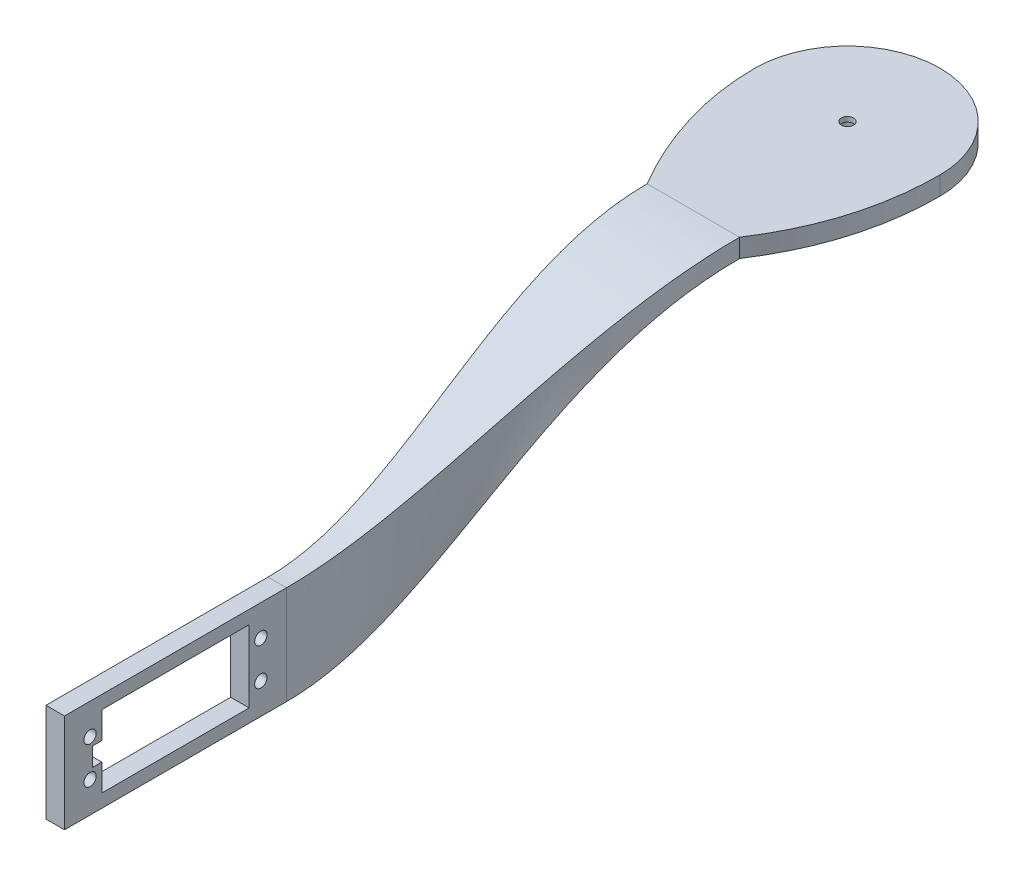
ISO-10303-21;
HEADER;
FILE_DESCRIPTION(('STEP AP214'),'2;1');
FILE_NAME('part.step','',(''),(''),'','','');
FILE_SCHEMA(('AUTOMOTIVE_DESIGN { 1 0 10303 214 1 1 1 1 }'));
ENDSEC;
DATA;
#1=APPLICATION_CONTEXT('core data for automotive mechanical design processes');
#2=APPLICATION_PROTOCOL_DEFINITION('international standard','automotive_design',2000,#1);
#3=PRODUCT_CONTEXT('',#1,'mechanical');
#4=PRODUCT('Part','Part','',(#3));
#5=PRODUCT_RELATED_PRODUCT_CATEGORY('part','',(#4));
#6=PRODUCT_DEFINITION_FORMATION('','',#4);
#7=PRODUCT_DEFINITION_CONTEXT('part definition',#1,'design');
#8=PRODUCT_DEFINITION('design','',#6,#7);
#9=PRODUCT_DEFINITION_SHAPE('','',#8);
#10=(LENGTH_UNIT() NAMED_UNIT(*) SI_UNIT(.MILLI.,.METRE.));
#11=(NAMED_UNIT(*) PLANE_ANGLE_UNIT() SI_UNIT($,.RADIAN.));
#12=(NAMED_UNIT(*) SI_UNIT($,.STERADIAN.) SOLID_ANGLE_UNIT());
#13=UNCERTAINTY_MEASURE_WITH_UNIT(LENGTH_MEASURE(1.E-05),#10,'distance_accuracy_value','');
#14=(GEOMETRIC_REPRESENTATION_CONTEXT(3) GLOBAL_UNCERTAINTY_ASSIGNED_CONTEXT((#13)) GLOBAL_UNIT_ASSIGNED_CONTEXT((#10,
#11,#12)) REPRESENTATION_CONTEXT('',''));
#15=CARTESIAN_POINT('',(0.,0.,0.));
#16=DIRECTION('',(0.,0.,1.));
#17=DIRECTION('',(1.,0.,0.));
#18=AXIS2_PLACEMENT_3D('',#15,#16,#17);
#19=CARTESIAN_POINT('',(-13.125,0.,12.3525004022516));
#20=DIRECTION('',(0.,-1.,0.));
#21=DIRECTION('',(0.,0.,-1.));
#22=AXIS2_PLACEMENT_3D('',#19,#20,#21);
#23=PLANE('',#22);
#24=CARTESIAN_POINT('',(-15.,0.,0.));
#25=CARTESIAN_POINT('',(-15.,0.,12.2050008045032));
#26=CARTESIAN_POINT('',(-7.49999999999999,0.,25.));
#27=B_SPLINE_CURVE_WITH_KNOTS('',2,(#24,#25,#26),.UNSPECIFIED.,.F.,.F.,(3,3),(0.,1.),.UNSPECIFIED.);
#28=CARTESIAN_POINT('',(-15.,0.,0.));
#29=VERTEX_POINT('',#28);
#30=CARTESIAN_POINT('',(-7.49999999999999,0.,25.));
#31=VERTEX_POINT('',#30);
#32=EDGE_CURVE('E303',#29,#31,#27,.T.);
#33=ORIENTED_EDGE('',*,*,#32,.F.);
#34=CARTESIAN_POINT('',(0.,0.,0.));
#35=DIRECTION('',(0.,1.,0.));
#36=DIRECTION('',(0.,0.,1.));
#37=AXIS2_PLACEMENT_3D('',#34,#35,#36);
#38=CIRCLE('',#37,15.);
#39=CARTESIAN_POINT('',(15.,0.,0.));
#40=VERTEX_POINT('',#39);
#41=EDGE_CURVE('E307',#40,#29,#38,.T.);
#42=ORIENTED_EDGE('',*,*,#41,.F.);
#43=CARTESIAN_POINT('',(7.5,0.,25.));
#44=CARTESIAN_POINT('',(15.,0.,13.5680719507911));
#45=CARTESIAN_POINT('',(15.,0.,0.));
#46=B_SPLINE_CURVE_WITH_KNOTS('',2,(#43,#44,#45),.UNSPECIFIED.,.F.,.F.,(3,3),(0.,1.),.UNSPECIFIED.);
#47=CARTESIAN_POINT('',(7.5,0.,25.));
#48=VERTEX_POINT('',#47);
#49=EDGE_CURVE('E380',#48,#40,#46,.T.);
#50=ORIENTED_EDGE('',*,*,#49,.F.);
#51=DIRECTION('',(1.,0.,0.));
#52=VECTOR('',#51,1.);
#53=CARTESIAN_POINT('',(-13.125,0.,25.));
#54=LINE('',#53,#52);
#55=EDGE_CURVE('E379',#31,#48,#54,.T.);
#56=ORIENTED_EDGE('',*,*,#55,.F.);
#57=EDGE_LOOP('',(#33,#42,#50,#56));
#58=FACE_BOUND('',#57,.T.);
#59=CARTESIAN_POINT('',(0.,0.,0.));
#60=DIRECTION('',(0.,-1.,0.));
#61=DIRECTION('',(0.,0.,-1.));
#62=AXIS2_PLACEMENT_3D('',#59,#60,#61);
#63=CIRCLE('',#62,4.);
#64=CARTESIAN_POINT('',(0.,0.,-4.));
#65=VERTEX_POINT('',#64);
#66=EDGE_CURVE('E298',#65,#65,#63,.T.);
#67=ORIENTED_EDGE('',*,*,#66,.F.);
#68=EDGE_LOOP('',(#67));
#69=FACE_BOUND('',#68,.T.);
#70=ADVANCED_FACE('F79',(#58,#69),#23,.T.);
#71=CARTESIAN_POINT('',(-15.,3.,0.));
#72=CARTESIAN_POINT('',(-15.,3.,12.2050008045032));
#73=CARTESIAN_POINT('',(-7.49999999999999,3.,25.));
#74=B_SPLINE_CURVE_WITH_KNOTS('',2,(#71,#72,#73),.UNSPECIFIED.,.F.,.F.,(3,3),(0.,1.),.UNSPECIFIED.);
#75=DIRECTION('',(0.,-1.,0.));
#76=VECTOR('',#75,1.);
#77=SURFACE_OF_LINEAR_EXTRUSION('',#74,#76);
#78=ORIENTED_EDGE('',*,*,#32,.T.);
#79=DIRECTION('',(0.,-1.,0.));
#80=VECTOR('',#79,1.);
#81=CARTESIAN_POINT('',(-7.49999999999999,3.,25.));
#82=LINE('',#81,#80);
#83=CARTESIAN_POINT('',(-7.49999999999999,3.00000000000001,25.));
#84=VERTEX_POINT('',#83);
#85=EDGE_CURVE('E149',#84,#31,#82,.T.);
#86=ORIENTED_EDGE('',*,*,#85,.F.);
#87=CARTESIAN_POINT('',(-15.,3.,0.));
#88=VERTEX_POINT('',#87);
#89=EDGE_CURVE('E124',#88,#84,#74,.T.);
#90=ORIENTED_EDGE('',*,*,#89,.F.);
#91=DIRECTION('',(0.,-1.,0.));
#92=VECTOR('',#91,1.);
#93=CARTESIAN_POINT('',(-15.,3.,0.));
#94=LINE('',#93,#92);
#95=EDGE_CURVE('E457',#88,#29,#94,.T.);
#96=ORIENTED_EDGE('',*,*,#95,.T.);
#97=EDGE_LOOP('',(#78,#86,#90,#96));
#98=FACE_BOUND('',#97,.T.);
#99=ADVANCED_FACE('F315',(#98),#77,.F.);
#100=CARTESIAN_POINT('',(7.5,3.,25.));
#101=CARTESIAN_POINT('',(15.,3.,13.5680719507911));
#102=CARTESIAN_POINT('',(15.,3.,0.));
#103=B_SPLINE_CURVE_WITH_KNOTS('',2,(#100,#101,#102),.UNSPECIFIED.,.F.,.F.,(3,3),(0.,1.),.UNSPECIFIED.);
#104=DIRECTION('',(0.,-1.,0.));
#105=VECTOR('',#104,1.);
#106=SURFACE_OF_LINEAR_EXTRUSION('',#103,#105);
#107=ORIENTED_EDGE('',*,*,#49,.T.);
#108=DIRECTION('',(0.,-1.,0.));
#109=VECTOR('',#108,1.);
#110=CARTESIAN_POINT('',(15.,3.,0.));
#111=LINE('',#110,#109);
#112=CARTESIAN_POINT('',(15.,3.,0.));
#113=VERTEX_POINT('',#112);
#114=EDGE_CURVE('E138',#113,#40,#111,.T.);
#115=ORIENTED_EDGE('',*,*,#114,.F.);
#116=CARTESIAN_POINT('',(7.5,3.,25.));
#117=VERTEX_POINT('',#116);
#118=EDGE_CURVE('E121',#117,#113,#103,.T.);
#119=ORIENTED_EDGE('',*,*,#118,.F.);
#120=DIRECTION('',(0.,-1.,0.));
#121=VECTOR('',#120,1.);
#122=CARTESIAN_POINT('',(7.5,3.,25.));
#123=LINE('',#122,#121);
#124=EDGE_CURVE('E135',#117,#48,#123,.T.);
#125=ORIENTED_EDGE('',*,*,#124,.T.);
#126=EDGE_LOOP('',(#107,#115,#119,#125));
#127=FACE_BOUND('',#126,.T.);
#128=ADVANCED_FACE('F134',(#127),#106,.F.);
#129=CARTESIAN_POINT('',(0.,3.,0.));
#130=DIRECTION('',(0.,-1.,0.));
#131=DIRECTION('',(0.,0.,-1.));
#132=AXIS2_PLACEMENT_3D('',#129,#130,#131);
#133=CYLINDRICAL_SURFACE('',#132,15.);
#134=ORIENTED_EDGE('',*,*,#41,.T.);
#135=ORIENTED_EDGE('',*,*,#95,.F.);
#136=CARTESIAN_POINT('',(0.,3.,0.));
#137=DIRECTION('',(0.,1.,0.));
#138=DIRECTION('',(0.,0.,1.));
#139=AXIS2_PLACEMENT_3D('',#136,#137,#138);
#140=CIRCLE('',#139,15.);
#141=EDGE_CURVE('E99',#113,#88,#140,.T.);
#142=ORIENTED_EDGE('',*,*,#141,.F.);
#143=ORIENTED_EDGE('',*,*,#114,.T.);
#144=EDGE_LOOP('',(#134,#135,#142,#143));
#145=FACE_BOUND('',#144,.T.);
#146=ADVANCED_FACE('F321',(#145),#133,.T.);
#147=CARTESIAN_POINT('',(-13.125,3.,12.3525004022516));
#148=DIRECTION('',(0.,-1.,0.));
#149=DIRECTION('',(0.,0.,-1.));
#150=AXIS2_PLACEMENT_3D('',#147,#148,#149);
#151=PLANE('',#150);
#152=CARTESIAN_POINT('',(0.,3.,0.));
#153=DIRECTION('',(0.,-1.,0.));
#154=DIRECTION('',(0.,0.,-1.));
#155=AXIS2_PLACEMENT_3D('',#152,#153,#154);
#156=CIRCLE('',#155,1.);
#157=CARTESIAN_POINT('',(0.,3.,-1.));
#158=VERTEX_POINT('',#157);
#159=EDGE_CURVE('E287',#158,#158,#156,.T.);
#160=ORIENTED_EDGE('',*,*,#159,.T.);
#161=EDGE_LOOP('',(#160));
#162=FACE_BOUND('',#161,.T.);
#163=ORIENTED_EDGE('',*,*,#89,.T.);
#164=DIRECTION('',(1.,0.,0.));
#165=VECTOR('',#164,1.);
#166=CARTESIAN_POINT('',(-13.125,3.,25.));
#167=LINE('',#166,#165);
#168=EDGE_CURVE('E118',#84,#117,#167,.T.);
#169=ORIENTED_EDGE('',*,*,#168,.T.);
#170=ORIENTED_EDGE('',*,*,#118,.T.);
#171=ORIENTED_EDGE('',*,*,#141,.T.);
#172=EDGE_LOOP('',(#163,#169,#170,#171));
#173=FACE_BOUND('',#172,.T.);
#174=ADVANCED_FACE('F120',(#162,#173),#151,.F.);
#175=CARTESIAN_POINT('',(0.,-1.,0.));
#176=DIRECTION('',(0.,1.,0.));
#177=DIRECTION('',(0.,0.,1.));
#178=AXIS2_PLACEMENT_3D('',#175,#176,#177);
#179=CYLINDRICAL_SURFACE('',#178,4.);
#180=CARTESIAN_POINT('',(0.,-0.300000000000003,0.));
#181=DIRECTION('',(0.,-1.,0.));
#182=DIRECTION('',(0.,0.,-1.));
#183=AXIS2_PLACEMENT_3D('',#180,#181,#182);
#184=CIRCLE('',#183,4.);
#185=CARTESIAN_POINT('',(0.,-0.300000000000003,-4.));
#186=VERTEX_POINT('',#185);
#187=EDGE_CURVE('E13',#186,#186,#184,.F.);
#188=ORIENTED_EDGE('',*,*,#187,.T.);
#189=EDGE_LOOP('',(#188));
#190=FACE_BOUND('',#189,.T.);
#191=ORIENTED_EDGE('',*,*,#66,.T.);
#192=EDGE_LOOP('',(#191));
#193=FACE_BOUND('',#192,.T.);
#194=ADVANCED_FACE('F330',(#190,#193),#179,.T.);
#195=CARTESIAN_POINT('',(0.,-1.,0.));
#196=DIRECTION('',(0.,-1.,0.));
#197=DIRECTION('',(0.,0.,-1.));
#198=AXIS2_PLACEMENT_3D('',#195,#196,#197);
#199=PLANE('',#198);
#200=CARTESIAN_POINT('',(0.,-1.,0.));
#201=DIRECTION('',(0.,-1.,0.));
#202=DIRECTION('',(0.,0.,-1.));
#203=AXIS2_PLACEMENT_3D('',#200,#201,#202);
#204=CIRCLE('',#203,3.3);
#205=CARTESIAN_POINT('',(0.,-1.,-3.3));
#206=VERTEX_POINT('',#205);
#207=EDGE_CURVE('E90',#206,#206,#204,.T.);
#208=ORIENTED_EDGE('',*,*,#207,.T.);
#209=EDGE_LOOP('',(#208));
#210=FACE_BOUND('',#209,.T.);
#211=CARTESIAN_POINT('',(0.,-1.,0.));
#212=DIRECTION('',(0.,-1.,0.));
#213=DIRECTION('',(0.,0.,-1.));
#214=AXIS2_PLACEMENT_3D('',#211,#212,#213);
#215=CIRCLE('',#214,2.45);
#216=CARTESIAN_POINT('',(0.,-1.,-2.45));
#217=VERTEX_POINT('',#216);
#218=EDGE_CURVE('E290',#217,#217,#215,.T.);
#219=ORIENTED_EDGE('',*,*,#218,.F.);
#220=EDGE_LOOP('',(#219));
#221=FACE_BOUND('',#220,.T.);
#222=ADVANCED_FACE('F334',(#210,#221),#199,.T.);
#223=CARTESIAN_POINT('',(0.,2.2,0.));
#224=DIRECTION('',(0.,-1.,0.));
#225=DIRECTION('',(0.,0.,-1.));
#226=AXIS2_PLACEMENT_3D('',#223,#224,#225);
#227=CYLINDRICAL_SURFACE('',#226,2.45);
#228=CARTESIAN_POINT('',(0.,2.2,0.));
#229=DIRECTION('',(0.,-1.,0.));
#230=DIRECTION('',(0.,0.,-1.));
#231=AXIS2_PLACEMENT_3D('',#228,#229,#230);
#232=CIRCLE('',#231,2.45);
#233=CARTESIAN_POINT('',(0.,2.2,-2.45));
#234=VERTEX_POINT('',#233);
#235=EDGE_CURVE('E295',#234,#234,#232,.T.);
#236=ORIENTED_EDGE('',*,*,#235,.F.);
#237=EDGE_LOOP('',(#236));
#238=FACE_BOUND('',#237,.T.);
#239=ORIENTED_EDGE('',*,*,#218,.T.);
#240=EDGE_LOOP('',(#239));
#241=FACE_BOUND('',#240,.T.);
#242=ADVANCED_FACE('F338',(#238,#241),#227,.F.);
#243=CARTESIAN_POINT('',(0.,2.2,0.));
#244=DIRECTION('',(0.,-1.,0.));
#245=DIRECTION('',(0.,0.,-1.));
#246=AXIS2_PLACEMENT_3D('',#243,#244,#245);
#247=PLANE('',#246);
#248=CARTESIAN_POINT('',(0.,2.2,0.));
#249=DIRECTION('',(0.,-1.,0.));
#250=DIRECTION('',(0.,0.,-1.));
#251=AXIS2_PLACEMENT_3D('',#248,#249,#250);
#252=CIRCLE('',#251,1.);
#253=CARTESIAN_POINT('',(0.,2.2,-1.));
#254=VERTEX_POINT('',#253);
#255=EDGE_CURVE('E291',#254,#254,#252,.T.);
#256=ORIENTED_EDGE('',*,*,#255,.F.);
#257=EDGE_LOOP('',(#256));
#258=FACE_BOUND('',#257,.T.);
#259=ORIENTED_EDGE('',*,*,#235,.T.);
#260=EDGE_LOOP('',(#259));
#261=FACE_BOUND('',#260,.T.);
#262=ADVANCED_FACE('F341',(#258,#261),#247,.T.);
#263=CARTESIAN_POINT('',(0.,3.,0.));
#264=DIRECTION('',(0.,-1.,0.));
#265=DIRECTION('',(0.,0.,-1.));
#266=AXIS2_PLACEMENT_3D('',#263,#264,#265);
#267=CYLINDRICAL_SURFACE('',#266,1.);
#268=CARTESIAN_POINT('',(0.,3.,-1.));
#269=CARTESIAN_POINT('',(0.,2.99166666666667,-1.));
#270=CARTESIAN_POINT('',(0.,2.98333333333333,-1.));
#271=CARTESIAN_POINT('',(0.,2.96666666666667,-1.));
#272=CARTESIAN_POINT('',(0.,2.95833333333333,-1.));
#273=CARTESIAN_POINT('',(0.,2.94166666666667,-1.));
#274=CARTESIAN_POINT('',(0.,2.93333333333333,-1.));
#275=CARTESIAN_POINT('',(0.,2.91666666666667,-1.));
#276=CARTESIAN_POINT('',(0.,2.90833333333333,-1.));
#277=CARTESIAN_POINT('',(0.,2.89166666666667,-1.));
#278=CARTESIAN_POINT('',(0.,2.88333333333333,-1.));
#279=CARTESIAN_POINT('',(0.,2.86666666666667,-1.));
#280=CARTESIAN_POINT('',(0.,2.85833333333333,-1.));
#281=CARTESIAN_POINT('',(0.,2.84166666666667,-1.));
#282=CARTESIAN_POINT('',(0.,2.83333333333333,-1.));
#283=CARTESIAN_POINT('',(0.,2.81666666666667,-1.));
#284=CARTESIAN_POINT('',(0.,2.80833333333333,-1.));
#285=CARTESIAN_POINT('',(0.,2.79166666666667,-1.));
#286=CARTESIAN_POINT('',(0.,2.78333333333333,-1.));
#287=CARTESIAN_POINT('',(0.,2.76666666666667,-1.));
#288=CARTESIAN_POINT('',(0.,2.75833333333333,-1.));
#289=CARTESIAN_POINT('',(0.,2.74166666666667,-1.));
#290=CARTESIAN_POINT('',(0.,2.73333333333333,-1.));
#291=CARTESIAN_POINT('',(0.,2.71666666666667,-1.));
#292=CARTESIAN_POINT('',(0.,2.70833333333333,-1.));
#293=CARTESIAN_POINT('',(0.,2.69166666666667,-1.));
#294=CARTESIAN_POINT('',(0.,2.68333333333333,-1.));
#295=CARTESIAN_POINT('',(0.,2.66666666666667,-1.));
#296=CARTESIAN_POINT('',(0.,2.65833333333333,-1.));
#297=CARTESIAN_POINT('',(0.,2.64166666666667,-1.));
#298=CARTESIAN_POINT('',(0.,2.63333333333333,-1.));
#299=CARTESIAN_POINT('',(0.,2.61666666666667,-1.));
#300=CARTESIAN_POINT('',(0.,2.60833333333333,-1.));
#301=CARTESIAN_POINT('',(0.,2.59166666666667,-1.));
#302=CARTESIAN_POINT('',(0.,2.58333333333333,-1.));
#303=CARTESIAN_POINT('',(0.,2.56666666666667,-1.));
#304=CARTESIAN_POINT('',(0.,2.55833333333333,-1.));
#305=CARTESIAN_POINT('',(0.,2.54166666666667,-1.));
#306=CARTESIAN_POINT('',(0.,2.53333333333333,-1.));
#307=CARTESIAN_POINT('',(0.,2.51666666666667,-1.));
#308=CARTESIAN_POINT('',(0.,2.50833333333333,-1.));
#309=CARTESIAN_POINT('',(0.,2.49166666666667,-1.));
#310=CARTESIAN_POINT('',(0.,2.48333333333333,-1.));
#311=CARTESIAN_POINT('',(0.,2.46666666666667,-1.));
#312=CARTESIAN_POINT('',(0.,2.45833333333333,-1.));
#313=CARTESIAN_POINT('',(0.,2.44166666666667,-1.));
#314=CARTESIAN_POINT('',(0.,2.43333333333333,-1.));
#315=CARTESIAN_POINT('',(0.,2.41666666666667,-1.));
#316=CARTESIAN_POINT('',(0.,2.40833333333333,-1.));
#317=CARTESIAN_POINT('',(0.,2.39166666666667,-1.));
#318=CARTESIAN_POINT('',(0.,2.38333333333333,-1.));
#319=CARTESIAN_POINT('',(0.,2.36666666666667,-1.));
#320=CARTESIAN_POINT('',(0.,2.35833333333333,-1.));
#321=CARTESIAN_POINT('',(0.,2.34166666666667,-1.));
#322=CARTESIAN_POINT('',(0.,2.33333333333333,-1.));
#323=CARTESIAN_POINT('',(0.,2.31666666666667,-1.));
#324=CARTESIAN_POINT('',(0.,2.30833333333333,-1.));
#325=CARTESIAN_POINT('',(0.,2.29166666666667,-1.));
#326=CARTESIAN_POINT('',(0.,2.28333333333333,-1.));
#327=CARTESIAN_POINT('',(0.,2.26666666666667,-1.));
#328=CARTESIAN_POINT('',(0.,2.25833333333333,-1.));
#329=CARTESIAN_POINT('',(0.,2.24166666666667,-1.));
#330=CARTESIAN_POINT('',(0.,2.23333333333333,-1.));
#331=CARTESIAN_POINT('',(0.,2.21666666666667,-1.));
#332=CARTESIAN_POINT('',(0.,2.20833333333333,-1.));
#333=CARTESIAN_POINT('',(0.,2.2,-1.));
#334=B_SPLINE_CURVE_WITH_KNOTS('',3,(#268,#269,#270,#271,#272,#273,#274,#275,#276,#277,#278,
#279,#280,#281,#282,#283,#284,#285,#286,#287,#288,#289,#290,#291,#292,#293,#294,#295,#296,#297,
#298,#299,#300,#301,#302,#303,#304,#305,#306,#307,#308,#309,#310,#311,#312,#313,#314,#315,#316,
#317,#318,#319,#320,#321,#322,#323,#324,#325,#326,#327,#328,#329,#330,#331,#332,#333),
.UNSPECIFIED.,.F.,.F.,(4,2,2,2,2,2,2,2,2,2,2,2,2,2,2,2,2,2,2,2,2,2,2,2,2,2,2,2,2,2,2,2,4),(0.,
0.0249999999999998,0.0499999999999997,0.075,0.0999999999999998,0.125,0.15,0.175,0.2,0.225,0.25,
0.275,0.3,0.325,0.35,0.375,0.4,0.425,0.45,0.475,0.5,0.525,0.55,0.575,0.6,0.625,0.65,0.675,0.7,
0.725,0.75,0.775,0.8),.UNSPECIFIED.);
#335=EDGE_CURVE('BSEAM206',#158,#254,#334,.T.);
#336=ORIENTED_EDGE('',*,*,#159,.F.);
#337=ORIENTED_EDGE('',*,*,#255,.T.);
#338=ORIENTED_EDGE('',*,*,#335,.T.);
#339=ORIENTED_EDGE('',*,*,#335,.F.);
#340=EDGE_LOOP('',(#336,#338,#337,#339));
#341=FACE_BOUND('',#340,.T.);
#342=ADVANCED_FACE('F206',(#341),#267,.F.);
#343=CARTESIAN_POINT('',(0.,-1.,0.));
#344=DIRECTION('',(0.,1.,0.));
#345=DIRECTION('',(0.,0.,1.));
#346=AXIS2_PLACEMENT_3D('',#343,#344,#345);
#347=CONICAL_SURFACE('',#346,3.3,0.785398163397447);
#348=ORIENTED_EDGE('',*,*,#187,.F.);
#349=EDGE_LOOP('',(#348));
#350=FACE_BOUND('',#349,.T.);
#351=ORIENTED_EDGE('',*,*,#207,.F.);
#352=EDGE_LOOP('',(#351));
#353=FACE_BOUND('',#352,.T.);
#354=ADVANCED_FACE('F81',(#350,#353),#347,.T.);
#355=CARTESIAN_POINT('',(-7.5,3.,25.));
#356=CARTESIAN_POINT('',(-7.5,3.,50.2919459825624));
#357=CARTESIAN_POINT('',(-10.,-24.,62.3557806717853));
#358=CARTESIAN_POINT('',(-10.,-24.,84.));
#359=CARTESIAN_POINT('',(-7.5,2.,25.));
#360=CARTESIAN_POINT('',(-7.5,2.,52.1674516499134));
#361=CARTESIAN_POINT('',(-10.,-29.3333333333333,61.6455246726361));
#362=CARTESIAN_POINT('',(-10.,-29.3333333333333,84.));
#363=CARTESIAN_POINT('',(-7.5,1.,25.));
#364=CARTESIAN_POINT('',(-7.5,0.999999999999999,54.0429573172644));
#365=CARTESIAN_POINT('',(-10.,-34.6666666666667,60.9352686734869));
#366=CARTESIAN_POINT('',(-10.,-34.6666666666667,84.));
#367=CARTESIAN_POINT('',(-7.5,0.,25.));
#368=CARTESIAN_POINT('',(-7.5,0.,55.9184629846154));
#369=CARTESIAN_POINT('',(-10.,-40.,60.2250126743378));
#370=CARTESIAN_POINT('',(-10.,-40.,84.));
#371=B_SPLINE_SURFACE_WITH_KNOTS('',3,3,((#355,#356,#357,#358),(#359,#360,#361,#362),(#363,#364,
#365,#366),(#367,#368,#369,#370)),.UNSPECIFIED.,.F.,.F.,.F.,(4,4),(4,4),(0.,1.),(0.,1.),.UNSPECIFIED.);
#372=CARTESIAN_POINT('',(-7.5,0.,25.));
#373=CARTESIAN_POINT('',(-7.5,0.,55.9184629846154));
#374=CARTESIAN_POINT('',(-10.,-40.,60.2250126743378));
#375=CARTESIAN_POINT('',(-10.,-40.,84.));
#376=B_SPLINE_CURVE_WITH_KNOTS('',3,(#372,#373,#374,#375),.UNSPECIFIED.,.F.,.F.,(4,4),(0.,1.),.UNSPECIFIED.);
#377=CARTESIAN_POINT('',(-10.,-40.,84.));
#378=VERTEX_POINT('',#377);
#379=EDGE_CURVE('E294',#31,#378,#376,.T.);
#380=DIRECTION('',(0.,-1.,0.));
#381=VECTOR('',#380,1.);
#382=CARTESIAN_POINT('',(-10.,-40.,84.));
#383=LINE('',#382,#381);
#384=CARTESIAN_POINT('',(-10.,-24.,84.));
#385=VERTEX_POINT('',#384);
#386=EDGE_CURVE('E159',#385,#378,#383,.T.);
#387=CARTESIAN_POINT('',(-7.5,3.,25.));
#388=CARTESIAN_POINT('',(-7.5,3.,50.2919459825624));
#389=CARTESIAN_POINT('',(-10.,-24.,62.3557806717853));
#390=CARTESIAN_POINT('',(-10.,-24.,84.));
#391=B_SPLINE_CURVE_WITH_KNOTS('',3,(#387,#388,#389,#390),.UNSPECIFIED.,.F.,.F.,(4,4),(0.,1.),.UNSPECIFIED.);
#392=EDGE_CURVE('E157',#385,#84,#391,.F.);
#393=ORIENTED_EDGE('',*,*,#85,.T.);
#394=ORIENTED_EDGE('',*,*,#379,.T.);
#395=ORIENTED_EDGE('',*,*,#386,.F.);
#396=ORIENTED_EDGE('',*,*,#392,.T.);
#397=EDGE_LOOP('',(#393,#394,#395,#396));
#398=FACE_BOUND('',#397,.T.);
#399=ADVANCED_FACE('F266',(#398),#371,.T.);
#400=CARTESIAN_POINT('',(-7.5,0.,25.));
#401=CARTESIAN_POINT('',(-7.5,0.,55.9184629846154));
#402=CARTESIAN_POINT('',(-10.,-40.,60.2250126743378));
#403=CARTESIAN_POINT('',(-10.,-40.,84.));
#404=CARTESIAN_POINT('',(-2.5,0.,25.));
#405=CARTESIAN_POINT('',(-2.5,0.,56.3213553259658));
#406=CARTESIAN_POINT('',(-9.00000000000001,-40.,60.0676774840096));
#407=CARTESIAN_POINT('',(-9.,-40.,84.));
#408=CARTESIAN_POINT('',(2.5,0.,25.));
#409=CARTESIAN_POINT('',(2.50000000000001,0.,56.7242476673162));
#410=CARTESIAN_POINT('',(-8.,-40.,59.9103422936814));
#411=CARTESIAN_POINT('',(-8.,-40.,84.));
#412=CARTESIAN_POINT('',(7.5,0.,25.));
#413=CARTESIAN_POINT('',(7.50000000000001,0.,57.1271400086666));
#414=CARTESIAN_POINT('',(-7.,-40.,59.7530071033532));
#415=CARTESIAN_POINT('',(-7.,-40.,84.));
#416=B_SPLINE_SURFACE_WITH_KNOTS('',3,3,((#400,#401,#402,#403),(#404,#405,#406,#407),(#408,#409,
#410,#411),(#412,#413,#414,#415)),.UNSPECIFIED.,.F.,.F.,.F.,(4,4),(4,4),(0.,1.),(0.,1.),.UNSPECIFIED.);
#417=CARTESIAN_POINT('',(7.5,0.,25.));
#418=CARTESIAN_POINT('',(7.50000000000001,0.,57.1271400086666));
#419=CARTESIAN_POINT('',(-7.,-40.,59.7530071033532));
#420=CARTESIAN_POINT('',(-7.,-40.,84.));
#421=B_SPLINE_CURVE_WITH_KNOTS('',3,(#417,#418,#419,#420),.UNSPECIFIED.,.F.,.F.,(4,4),(0.,1.),.UNSPECIFIED.);
#422=CARTESIAN_POINT('',(-7.,-40.,84.));
#423=VERTEX_POINT('',#422);
#424=EDGE_CURVE('E148',#48,#423,#421,.T.);
#425=DIRECTION('',(1.,0.,0.));
#426=VECTOR('',#425,1.);
#427=CARTESIAN_POINT('',(-10.,-40.,84.));
#428=LINE('',#427,#426);
#429=EDGE_CURVE('E230',#378,#423,#428,.T.);
#430=ORIENTED_EDGE('',*,*,#55,.T.);
#431=ORIENTED_EDGE('',*,*,#424,.T.);
#432=ORIENTED_EDGE('',*,*,#429,.F.);
#433=ORIENTED_EDGE('',*,*,#379,.F.);
#434=EDGE_LOOP('',(#430,#431,#432,#433));
#435=FACE_BOUND('',#434,.T.);
#436=ADVANCED_FACE('F190',(#435),#416,.T.);
#437=CARTESIAN_POINT('',(7.5,3.,25.));
#438=CARTESIAN_POINT('',(7.50000000000001,3.,51.6891583176258));
#439=CARTESIAN_POINT('',(-7.00000000000005,-24.0000000000001,61.8383467833204));
#440=CARTESIAN_POINT('',(-7.,-24.,84.));
#441=CARTESIAN_POINT('',(2.5,3.,25.));
#442=CARTESIAN_POINT('',(2.5,3.,51.2234208726046));
#443=CARTESIAN_POINT('',(-8.00000000000003,-24.0000000000001,62.0108247461421));
#444=CARTESIAN_POINT('',(-8.,-24.,84.));
#445=CARTESIAN_POINT('',(-2.5,3.,25.));
#446=CARTESIAN_POINT('',(-2.5,3.,50.7576834275835));
#447=CARTESIAN_POINT('',(-9.00000000000002,-24.,62.1833027089637));
#448=CARTESIAN_POINT('',(-9.,-24.,84.));
#449=CARTESIAN_POINT('',(-7.5,3.,25.));
#450=CARTESIAN_POINT('',(-7.5,3.,50.2919459825624));
#451=CARTESIAN_POINT('',(-10.,-24.,62.3557806717853));
#452=CARTESIAN_POINT('',(-10.,-24.,84.));
#453=B_SPLINE_SURFACE_WITH_KNOTS('',3,3,((#437,#438,#439,#440),(#441,#442,#443,#444),(#445,#446,
#447,#448),(#449,#450,#451,#452)),.UNSPECIFIED.,.F.,.F.,.F.,(4,4),(4,4),(0.,1.),(0.,1.),.UNSPECIFIED.);
#454=DIRECTION('',(1.,0.,0.));
#455=VECTOR('',#454,1.);
#456=CARTESIAN_POINT('',(-10.,-24.,84.));
#457=LINE('',#456,#455);
#458=CARTESIAN_POINT('',(-7.,-24.,84.));
#459=VERTEX_POINT('',#458);
#460=EDGE_CURVE('E153',#385,#459,#457,.T.);
#461=CARTESIAN_POINT('',(7.5,3.,25.));
#462=CARTESIAN_POINT('',(7.50000000000001,3.,51.6891583176258));
#463=CARTESIAN_POINT('',(-7.00000000000005,-24.0000000000001,61.8383467833204));
#464=CARTESIAN_POINT('',(-7.,-24.,84.));
#465=B_SPLINE_CURVE_WITH_KNOTS('',3,(#461,#462,#463,#464),.UNSPECIFIED.,.F.,.F.,(4,4),(0.,1.),.UNSPECIFIED.);
#466=EDGE_CURVE('E145',#117,#459,#465,.T.);
#467=ORIENTED_EDGE('',*,*,#168,.F.);
#468=ORIENTED_EDGE('',*,*,#392,.F.);
#469=ORIENTED_EDGE('',*,*,#460,.T.);
#470=ORIENTED_EDGE('',*,*,#466,.F.);
#471=EDGE_LOOP('',(#467,#468,#469,#470));
#472=FACE_BOUND('',#471,.T.);
#473=ADVANCED_FACE('F151',(#472),#453,.T.);
#474=CARTESIAN_POINT('',(7.5,0.,25.));
#475=CARTESIAN_POINT('',(7.50000000000001,0.,57.1271400086666));
#476=CARTESIAN_POINT('',(-7.,-40.,59.7530071033532));
#477=CARTESIAN_POINT('',(-7.,-40.,84.));
#478=CARTESIAN_POINT('',(7.5,1.,25.));
#479=CARTESIAN_POINT('',(7.50000000000001,0.999999999999999,55.3144794449863));
#480=CARTESIAN_POINT('',(-7.00000000000002,-34.6666666666667,60.4481203300089));
#481=CARTESIAN_POINT('',(-7.,-34.6666666666667,84.));
#482=CARTESIAN_POINT('',(7.5,2.,25.));
#483=CARTESIAN_POINT('',(7.50000000000001,2.,53.5018188813061));
#484=CARTESIAN_POINT('',(-7.00000000000003,-29.3333333333334,61.1432335566647));
#485=CARTESIAN_POINT('',(-7.,-29.3333333333333,84.));
#486=CARTESIAN_POINT('',(7.5,3.,25.));
#487=CARTESIAN_POINT('',(7.50000000000001,3.,51.6891583176258));
#488=CARTESIAN_POINT('',(-7.00000000000005,-24.0000000000001,61.8383467833204));
#489=CARTESIAN_POINT('',(-7.,-24.,84.));
#490=B_SPLINE_SURFACE_WITH_KNOTS('',3,3,((#474,#475,#476,#477),(#478,#479,#480,#481),(#482,#483,
#484,#485),(#486,#487,#488,#489)),.UNSPECIFIED.,.F.,.F.,.F.,(4,4),(4,4),(0.,1.),(0.,1.),.UNSPECIFIED.);
#491=DIRECTION('',(0.,-1.,0.));
#492=VECTOR('',#491,1.);
#493=CARTESIAN_POINT('',(-7.,-40.,84.));
#494=LINE('',#493,#492);
#495=EDGE_CURVE('E83',#459,#423,#494,.T.);
#496=ORIENTED_EDGE('',*,*,#124,.F.);
#497=ORIENTED_EDGE('',*,*,#466,.T.);
#498=ORIENTED_EDGE('',*,*,#495,.T.);
#499=ORIENTED_EDGE('',*,*,#424,.F.);
#500=EDGE_LOOP('',(#496,#497,#498,#499));
#501=FACE_BOUND('',#500,.T.);
#502=ADVANCED_FACE('F143',(#501),#490,.T.);
#503=CARTESIAN_POINT('',(-7.,0.,0.));
#504=DIRECTION('',(-1.,0.,0.));
#505=DIRECTION('',(0.,0.,1.));
#506=AXIS2_PLACEMENT_3D('',#503,#504,#505);
#507=PLANE('',#506);
#508=CARTESIAN_POINT('',(-7.,-29.,115.85));
#509=DIRECTION('',(1.,0.,0.));
#510=DIRECTION('',(0.,0.,-1.));
#511=AXIS2_PLACEMENT_3D('',#508,#509,#510);
#512=CIRCLE('',#511,0.999999999999998);
#513=CARTESIAN_POINT('',(-7.,-29.,114.85));
#514=VERTEX_POINT('',#513);
#515=EDGE_CURVE('E647',#514,#514,#512,.T.);
#516=ORIENTED_EDGE('',*,*,#515,.F.);
#517=EDGE_LOOP('',(#516));
#518=FACE_BOUND('',#517,.T.);
#519=CARTESIAN_POINT('',(-7.,-35.,115.85));
#520=DIRECTION('',(1.,0.,0.));
#521=DIRECTION('',(0.,0.,-1.));
#522=AXIS2_PLACEMENT_3D('',#519,#520,#521);
#523=CIRCLE('',#522,0.999999999999998);
#524=CARTESIAN_POINT('',(-7.,-35.,114.85));
#525=VERTEX_POINT('',#524);
#526=EDGE_CURVE('E641',#525,#525,#523,.T.);
#527=ORIENTED_EDGE('',*,*,#526,.F.);
#528=EDGE_LOOP('',(#527));
#529=FACE_BOUND('',#528,.T.);
#530=CARTESIAN_POINT('',(-7.,-35.,88.15));
#531=DIRECTION('',(1.,0.,0.));
#532=DIRECTION('',(0.,0.,-1.));
#533=AXIS2_PLACEMENT_3D('',#530,#531,#532);
#534=CIRCLE('',#533,0.999999999999998);
#535=CARTESIAN_POINT('',(-7.,-35.,87.15));
#536=VERTEX_POINT('',#535);
#537=EDGE_CURVE('E635',#536,#536,#534,.T.);
#538=ORIENTED_EDGE('',*,*,#537,.F.);
#539=EDGE_LOOP('',(#538));
#540=FACE_BOUND('',#539,.T.);
#541=CARTESIAN_POINT('',(-7.,-29.,88.15));
#542=DIRECTION('',(1.,0.,0.));
#543=DIRECTION('',(0.,0.,-1.));
#544=AXIS2_PLACEMENT_3D('',#541,#542,#543);
#545=CIRCLE('',#544,0.999999999999998);
#546=CARTESIAN_POINT('',(-7.,-29.,87.15));
#547=VERTEX_POINT('',#546);
#548=EDGE_CURVE('E616',#547,#547,#545,.T.);
#549=ORIENTED_EDGE('',*,*,#548,.F.);
#550=EDGE_LOOP('',(#549));
#551=FACE_BOUND('',#550,.T.);
#552=DIRECTION('',(0.,0.,1.));
#553=VECTOR('',#552,1.);
#554=CARTESIAN_POINT('',(-7.,-40.,120.));
#555=LINE('',#554,#553);
#556=CARTESIAN_POINT('',(-7.,-40.,120.));
#557=VERTEX_POINT('',#556);
#558=EDGE_CURVE('E398',#423,#557,#555,.T.);
#559=ORIENTED_EDGE('',*,*,#558,.F.);
#560=ORIENTED_EDGE('',*,*,#495,.F.);
#561=DIRECTION('',(0.,0.,-1.));
#562=VECTOR('',#561,1.);
#563=CARTESIAN_POINT('',(-7.,-24.,120.));
#564=LINE('',#563,#562);
#565=CARTESIAN_POINT('',(-7.,-24.,120.));
#566=VERTEX_POINT('',#565);
#567=EDGE_CURVE('E429',#566,#459,#564,.T.);
#568=ORIENTED_EDGE('',*,*,#567,.F.);
#569=DIRECTION('',(0.,1.,0.));
#570=VECTOR('',#569,1.);
#571=CARTESIAN_POINT('',(-7.,-40.,120.));
#572=LINE('',#571,#570);
#573=EDGE_CURVE('E410',#557,#566,#572,.T.);
#574=ORIENTED_EDGE('',*,*,#573,.F.);
#575=EDGE_LOOP('',(#559,#560,#568,#574));
#576=FACE_BOUND('',#575,.T.);
#577=DIRECTION('',(0.,0.,-1.));
#578=VECTOR('',#577,1.);
#579=CARTESIAN_POINT('',(-7.,-26.15,90.05));
#580=LINE('',#579,#578);
#581=CARTESIAN_POINT('',(-7.,-26.15,113.95));
#582=VERTEX_POINT('',#581);
#583=CARTESIAN_POINT('',(-7.,-26.15,90.05));
#584=VERTEX_POINT('',#583);
#585=EDGE_CURVE('E521',#582,#584,#580,.T.);
#586=ORIENTED_EDGE('',*,*,#585,.T.);
#587=DIRECTION('',(0.,-1.,0.));
#588=VECTOR('',#587,1.);
#589=CARTESIAN_POINT('',(-7.,-26.15,90.05));
#590=LINE('',#589,#588);
#591=CARTESIAN_POINT('',(-7.,-37.85,90.05));
#592=VERTEX_POINT('',#591);
#593=EDGE_CURVE('E416',#584,#592,#590,.T.);
#594=ORIENTED_EDGE('',*,*,#593,.T.);
#595=DIRECTION('',(0.,0.,1.));
#596=VECTOR('',#595,1.);
#597=CARTESIAN_POINT('',(-7.,-37.85,90.05));
#598=LINE('',#597,#596);
#599=CARTESIAN_POINT('',(-7.,-37.85,113.95));
#600=VERTEX_POINT('',#599);
#601=EDGE_CURVE('E496',#592,#600,#598,.T.);
#602=ORIENTED_EDGE('',*,*,#601,.T.);
#603=DIRECTION('',(0.,1.,0.));
#604=VECTOR('',#603,1.);
#605=CARTESIAN_POINT('',(-7.,-33.5,113.95));
#606=LINE('',#605,#604);
#607=CARTESIAN_POINT('',(-7.,-33.5,113.95));
#608=VERTEX_POINT('',#607);
#609=EDGE_CURVE('E533',#600,#608,#606,.T.);
#610=ORIENTED_EDGE('',*,*,#609,.T.);
#611=DIRECTION('',(0.,0.,1.));
#612=VECTOR('',#611,1.);
#613=CARTESIAN_POINT('',(-7.,-33.5,115.45));
#614=LINE('',#613,#612);
#615=CARTESIAN_POINT('',(-7.,-33.5,115.45));
#616=VERTEX_POINT('',#615);
#617=EDGE_CURVE('E547',#608,#616,#614,.T.);
#618=ORIENTED_EDGE('',*,*,#617,.T.);
#619=DIRECTION('',(0.,1.,0.));
#620=VECTOR('',#619,1.);
#621=CARTESIAN_POINT('',(-7.,-30.5,115.45));
#622=LINE('',#621,#620);
#623=CARTESIAN_POINT('',(-7.,-30.5,115.45));
#624=VERTEX_POINT('',#623);
#625=EDGE_CURVE('E562',#616,#624,#622,.T.);
#626=ORIENTED_EDGE('',*,*,#625,.T.);
#627=DIRECTION('',(0.,0.,-1.));
#628=VECTOR('',#627,1.);
#629=CARTESIAN_POINT('',(-7.,-30.5,113.95));
#630=LINE('',#629,#628);
#631=CARTESIAN_POINT('',(-7.,-30.5,113.95));
#632=VERTEX_POINT('',#631);
#633=EDGE_CURVE('E577',#624,#632,#630,.T.);
#634=ORIENTED_EDGE('',*,*,#633,.T.);
#635=DIRECTION('',(0.,1.,0.));
#636=VECTOR('',#635,1.);
#637=CARTESIAN_POINT('',(-7.,-26.15,113.95));
#638=LINE('',#637,#636);
#639=EDGE_CURVE('E592',#632,#582,#638,.T.);
#640=ORIENTED_EDGE('',*,*,#639,.T.);
#641=EDGE_LOOP('',(#586,#594,#602,#610,#618,#626,#634,#640));
#642=FACE_BOUND('',#641,.T.);
#643=ADVANCED_FACE('F205',(#518,#529,#540,#551,#576,#642),#507,.F.);
#644=CARTESIAN_POINT('',(-10.,0.,0.));
#645=DIRECTION('',(-1.,0.,0.));
#646=DIRECTION('',(0.,0.,1.));
#647=AXIS2_PLACEMENT_3D('',#644,#645,#646);
#648=PLANE('',#647);
#649=CARTESIAN_POINT('',(-10.,-29.,115.85));
#650=DIRECTION('',(1.,0.,0.));
#651=DIRECTION('',(0.,0.,-1.));
#652=AXIS2_PLACEMENT_3D('',#649,#650,#651);
#653=CIRCLE('',#652,0.999999999999998);
#654=CARTESIAN_POINT('',(-10.,-29.,114.85));
#655=VERTEX_POINT('',#654);
#656=EDGE_CURVE('E650',#655,#655,#653,.T.);
#657=ORIENTED_EDGE('',*,*,#656,.T.);
#658=EDGE_LOOP('',(#657));
#659=FACE_BOUND('',#658,.T.);
#660=CARTESIAN_POINT('',(-10.,-35.,115.85));
#661=DIRECTION('',(1.,0.,0.));
#662=DIRECTION('',(0.,0.,-1.));
#663=AXIS2_PLACEMENT_3D('',#660,#661,#662);
#664=CIRCLE('',#663,0.999999999999998);
#665=CARTESIAN_POINT('',(-10.,-35.,114.85));
#666=VERTEX_POINT('',#665);
#667=EDGE_CURVE('E644',#666,#666,#664,.T.);
#668=ORIENTED_EDGE('',*,*,#667,.T.);
#669=EDGE_LOOP('',(#668));
#670=FACE_BOUND('',#669,.T.);
#671=CARTESIAN_POINT('',(-10.,-35.,88.15));
#672=DIRECTION('',(1.,0.,0.));
#673=DIRECTION('',(0.,0.,-1.));
#674=AXIS2_PLACEMENT_3D('',#671,#672,#673);
#675=CIRCLE('',#674,0.999999999999998);
#676=CARTESIAN_POINT('',(-10.,-35.,87.15));
#677=VERTEX_POINT('',#676);
#678=EDGE_CURVE('E638',#677,#677,#675,.T.);
#679=ORIENTED_EDGE('',*,*,#678,.T.);
#680=EDGE_LOOP('',(#679));
#681=FACE_BOUND('',#680,.T.);
#682=CARTESIAN_POINT('',(-10.,-29.,88.15));
#683=DIRECTION('',(1.,0.,0.));
#684=DIRECTION('',(0.,0.,-1.));
#685=AXIS2_PLACEMENT_3D('',#682,#683,#684);
#686=CIRCLE('',#685,0.999999999999998);
#687=CARTESIAN_POINT('',(-10.,-29.,87.15));
#688=VERTEX_POINT('',#687);
#689=EDGE_CURVE('E618',#688,#688,#686,.T.);
#690=ORIENTED_EDGE('',*,*,#689,.T.);
#691=EDGE_LOOP('',(#690));
#692=FACE_BOUND('',#691,.T.);
#693=DIRECTION('',(0.,0.,1.));
#694=VECTOR('',#693,1.);
#695=CARTESIAN_POINT('',(-10.,-40.,120.));
#696=LINE('',#695,#694);
#697=CARTESIAN_POINT('',(-10.,-40.,120.));
#698=VERTEX_POINT('',#697);
#699=EDGE_CURVE('E400',#378,#698,#696,.T.);
#700=ORIENTED_EDGE('',*,*,#699,.T.);
#701=DIRECTION('',(0.,1.,0.));
#702=VECTOR('',#701,1.);
#703=CARTESIAN_POINT('',(-10.,-40.,120.));
#704=LINE('',#703,#702);
#705=CARTESIAN_POINT('',(-10.,-24.,120.));
#706=VERTEX_POINT('',#705);
#707=EDGE_CURVE('E425',#698,#706,#704,.T.);
#708=ORIENTED_EDGE('',*,*,#707,.T.);
#709=DIRECTION('',(0.,0.,-1.));
#710=VECTOR('',#709,1.);
#711=CARTESIAN_POINT('',(-10.,-24.,120.));
#712=LINE('',#711,#710);
#713=EDGE_CURVE('E426',#706,#385,#712,.T.);
#714=ORIENTED_EDGE('',*,*,#713,.T.);
#715=ORIENTED_EDGE('',*,*,#386,.T.);
#716=EDGE_LOOP('',(#700,#708,#714,#715));
#717=FACE_BOUND('',#716,.T.);
#718=DIRECTION('',(0.,-1.,0.));
#719=VECTOR('',#718,1.);
#720=CARTESIAN_POINT('',(-10.,-26.15,90.05));
#721=LINE('',#720,#719);
#722=CARTESIAN_POINT('',(-10.,-26.15,90.05));
#723=VERTEX_POINT('',#722);
#724=CARTESIAN_POINT('',(-10.,-37.85,90.05));
#725=VERTEX_POINT('',#724);
#726=EDGE_CURVE('E411',#723,#725,#721,.T.);
#727=ORIENTED_EDGE('',*,*,#726,.F.);
#728=DIRECTION('',(0.,0.,-1.));
#729=VECTOR('',#728,1.);
#730=CARTESIAN_POINT('',(-10.,-26.15,90.05));
#731=LINE('',#730,#729);
#732=CARTESIAN_POINT('',(-10.,-26.15,113.95));
#733=VERTEX_POINT('',#732);
#734=EDGE_CURVE('E606',#733,#723,#731,.T.);
#735=ORIENTED_EDGE('',*,*,#734,.F.);
#736=DIRECTION('',(0.,1.,0.));
#737=VECTOR('',#736,1.);
#738=CARTESIAN_POINT('',(-10.,-26.15,113.95));
#739=LINE('',#738,#737);
#740=CARTESIAN_POINT('',(-10.,-30.5,113.95));
#741=VERTEX_POINT('',#740);
#742=EDGE_CURVE('E586',#741,#733,#739,.T.);
#743=ORIENTED_EDGE('',*,*,#742,.F.);
#744=DIRECTION('',(0.,0.,-1.));
#745=VECTOR('',#744,1.);
#746=CARTESIAN_POINT('',(-10.,-30.5,113.95));
#747=LINE('',#746,#745);
#748=CARTESIAN_POINT('',(-10.,-30.5,115.45));
#749=VERTEX_POINT('',#748);
#750=EDGE_CURVE('E571',#749,#741,#747,.T.);
#751=ORIENTED_EDGE('',*,*,#750,.F.);
#752=DIRECTION('',(0.,1.,0.));
#753=VECTOR('',#752,1.);
#754=CARTESIAN_POINT('',(-10.,-30.5,115.45));
#755=LINE('',#754,#753);
#756=CARTESIAN_POINT('',(-10.,-33.5,115.45));
#757=VERTEX_POINT('',#756);
#758=EDGE_CURVE('E556',#757,#749,#755,.T.);
#759=ORIENTED_EDGE('',*,*,#758,.F.);
#760=DIRECTION('',(0.,0.,1.));
#761=VECTOR('',#760,1.);
#762=CARTESIAN_POINT('',(-10.,-33.5,115.45));
#763=LINE('',#762,#761);
#764=CARTESIAN_POINT('',(-10.,-33.5,113.95));
#765=VERTEX_POINT('',#764);
#766=EDGE_CURVE('E541',#765,#757,#763,.T.);
#767=ORIENTED_EDGE('',*,*,#766,.F.);
#768=DIRECTION('',(0.,1.,0.));
#769=VECTOR('',#768,1.);
#770=CARTESIAN_POINT('',(-10.,-33.5,113.95));
#771=LINE('',#770,#769);
#772=CARTESIAN_POINT('',(-10.,-37.85,113.95));
#773=VERTEX_POINT('',#772);
#774=EDGE_CURVE('E507',#773,#765,#771,.T.);
#775=ORIENTED_EDGE('',*,*,#774,.F.);
#776=DIRECTION('',(0.,0.,1.));
#777=VECTOR('',#776,1.);
#778=CARTESIAN_POINT('',(-10.,-37.85,90.05));
#779=LINE('',#778,#777);
#780=EDGE_CURVE('E517',#725,#773,#779,.T.);
#781=ORIENTED_EDGE('',*,*,#780,.F.);
#782=EDGE_LOOP('',(#727,#735,#743,#751,#759,#767,#775,#781));
#783=FACE_BOUND('',#782,.T.);
#784=ADVANCED_FACE('F249',(#659,#670,#681,#692,#717,#783),#648,.T.);
#785=CARTESIAN_POINT('',(-10.,-40.,120.));
#786=DIRECTION('',(0.,1.,0.));
#787=DIRECTION('',(0.,0.,1.));
#788=AXIS2_PLACEMENT_3D('',#785,#786,#787);
#789=PLANE('',#788);
#790=ORIENTED_EDGE('',*,*,#558,.T.);
#791=DIRECTION('',(1.,0.,0.));
#792=VECTOR('',#791,1.);
#793=CARTESIAN_POINT('',(-10.,-40.,120.));
#794=LINE('',#793,#792);
#795=EDGE_CURVE('E413',#698,#557,#794,.T.);
#796=ORIENTED_EDGE('',*,*,#795,.F.);
#797=ORIENTED_EDGE('',*,*,#699,.F.);
#798=ORIENTED_EDGE('',*,*,#429,.T.);
#799=EDGE_LOOP('',(#790,#796,#797,#798));
#800=FACE_BOUND('',#799,.T.);
#801=ADVANCED_FACE('F259',(#800),#789,.F.);
#802=CARTESIAN_POINT('',(-10.,-24.,120.));
#803=DIRECTION('',(0.,-1.,0.));
#804=DIRECTION('',(0.,0.,-1.));
#805=AXIS2_PLACEMENT_3D('',#802,#803,#804);
#806=PLANE('',#805);
#807=ORIENTED_EDGE('',*,*,#567,.T.);
#808=ORIENTED_EDGE('',*,*,#460,.F.);
#809=ORIENTED_EDGE('',*,*,#713,.F.);
#810=DIRECTION('',(1.,0.,0.));
#811=VECTOR('',#810,1.);
#812=CARTESIAN_POINT('',(-10.,-24.,120.));
#813=LINE('',#812,#811);
#814=EDGE_CURVE('E431',#706,#566,#813,.T.);
#815=ORIENTED_EDGE('',*,*,#814,.T.);
#816=EDGE_LOOP('',(#807,#808,#809,#815));
#817=FACE_BOUND('',#816,.T.);
#818=ADVANCED_FACE('F478',(#817),#806,.F.);
#819=CARTESIAN_POINT('',(-10.,-40.,120.));
#820=DIRECTION('',(0.,0.,-1.));
#821=DIRECTION('',(-1.,0.,0.));
#822=AXIS2_PLACEMENT_3D('',#819,#820,#821);
#823=PLANE('',#822);
#824=ORIENTED_EDGE('',*,*,#573,.T.);
#825=ORIENTED_EDGE('',*,*,#814,.F.);
#826=ORIENTED_EDGE('',*,*,#707,.F.);
#827=ORIENTED_EDGE('',*,*,#795,.T.);
#828=EDGE_LOOP('',(#824,#825,#826,#827));
#829=FACE_BOUND('',#828,.T.);
#830=ADVANCED_FACE('F261',(#829),#823,.F.);
#831=CARTESIAN_POINT('',(-10.,-26.15,90.05));
#832=DIRECTION('',(0.,-1.,0.));
#833=DIRECTION('',(0.,0.,-1.));
#834=AXIS2_PLACEMENT_3D('',#831,#832,#833);
#835=PLANE('',#834);
#836=ORIENTED_EDGE('',*,*,#585,.F.);
#837=DIRECTION('',(1.,0.,0.));
#838=VECTOR('',#837,1.);
#839=CARTESIAN_POINT('',(-10.,-26.15,113.95));
#840=LINE('',#839,#838);
#841=EDGE_CURVE('E603',#733,#582,#840,.T.);
#842=ORIENTED_EDGE('',*,*,#841,.F.);
#843=ORIENTED_EDGE('',*,*,#734,.T.);
#844=DIRECTION('',(1.,0.,0.));
#845=VECTOR('',#844,1.);
#846=CARTESIAN_POINT('',(-10.,-26.15,90.05));
#847=LINE('',#846,#845);
#848=EDGE_CURVE('E600',#723,#584,#847,.T.);
#849=ORIENTED_EDGE('',*,*,#848,.T.);
#850=EDGE_LOOP('',(#836,#842,#843,#849));
#851=FACE_BOUND('',#850,.T.);
#852=ADVANCED_FACE('F673',(#851),#835,.T.);
#853=CARTESIAN_POINT('',(-10.,-26.15,113.95));
#854=DIRECTION('',(0.,0.,-1.));
#855=DIRECTION('',(-1.,0.,0.));
#856=AXIS2_PLACEMENT_3D('',#853,#854,#855);
#857=PLANE('',#856);
#858=ORIENTED_EDGE('',*,*,#639,.F.);
#859=DIRECTION('',(1.,0.,0.));
#860=VECTOR('',#859,1.);
#861=CARTESIAN_POINT('',(-10.,-30.5,113.95));
#862=LINE('',#861,#860);
#863=EDGE_CURVE('E589',#741,#632,#862,.T.);
#864=ORIENTED_EDGE('',*,*,#863,.F.);
#865=ORIENTED_EDGE('',*,*,#742,.T.);
#866=ORIENTED_EDGE('',*,*,#841,.T.);
#867=EDGE_LOOP('',(#858,#864,#865,#866));
#868=FACE_BOUND('',#867,.T.);
#869=ADVANCED_FACE('F684',(#868),#857,.T.);
#870=CARTESIAN_POINT('',(-10.,-30.5,113.95));
#871=DIRECTION('',(0.,-1.,0.));
#872=DIRECTION('',(0.,0.,-1.));
#873=AXIS2_PLACEMENT_3D('',#870,#871,#872);
#874=PLANE('',#873);
#875=ORIENTED_EDGE('',*,*,#633,.F.);
#876=DIRECTION('',(1.,0.,0.));
#877=VECTOR('',#876,1.);
#878=CARTESIAN_POINT('',(-10.,-30.5,115.45));
#879=LINE('',#878,#877);
#880=EDGE_CURVE('E574',#749,#624,#879,.T.);
#881=ORIENTED_EDGE('',*,*,#880,.F.);
#882=ORIENTED_EDGE('',*,*,#750,.T.);
#883=ORIENTED_EDGE('',*,*,#863,.T.);
#884=EDGE_LOOP('',(#875,#881,#882,#883));
#885=FACE_BOUND('',#884,.T.);
#886=ADVANCED_FACE('F690',(#885),#874,.T.);
#887=CARTESIAN_POINT('',(-10.,-30.5,115.45));
#888=DIRECTION('',(0.,0.,-1.));
#889=DIRECTION('',(-1.,0.,0.));
#890=AXIS2_PLACEMENT_3D('',#887,#888,#889);
#891=PLANE('',#890);
#892=ORIENTED_EDGE('',*,*,#625,.F.);
#893=DIRECTION('',(1.,0.,0.));
#894=VECTOR('',#893,1.);
#895=CARTESIAN_POINT('',(-10.,-33.5,115.45));
#896=LINE('',#895,#894);
#897=EDGE_CURVE('E559',#757,#616,#896,.T.);
#898=ORIENTED_EDGE('',*,*,#897,.F.);
#899=ORIENTED_EDGE('',*,*,#758,.T.);
#900=ORIENTED_EDGE('',*,*,#880,.T.);
#901=EDGE_LOOP('',(#892,#898,#899,#900));
#902=FACE_BOUND('',#901,.T.);
#903=ADVANCED_FACE('F695',(#902),#891,.T.);
#904=CARTESIAN_POINT('',(-10.,-33.5,115.45));
#905=DIRECTION('',(0.,1.,0.));
#906=DIRECTION('',(0.,0.,1.));
#907=AXIS2_PLACEMENT_3D('',#904,#905,#906);
#908=PLANE('',#907);
#909=ORIENTED_EDGE('',*,*,#617,.F.);
#910=DIRECTION('',(1.,0.,0.));
#911=VECTOR('',#910,1.);
#912=CARTESIAN_POINT('',(-10.,-33.5,113.95));
#913=LINE('',#912,#911);
#914=EDGE_CURVE('E544',#765,#608,#913,.T.);
#915=ORIENTED_EDGE('',*,*,#914,.F.);
#916=ORIENTED_EDGE('',*,*,#766,.T.);
#917=ORIENTED_EDGE('',*,*,#897,.T.);
#918=EDGE_LOOP('',(#909,#915,#916,#917));
#919=FACE_BOUND('',#918,.T.);
#920=ADVANCED_FACE('F699',(#919),#908,.T.);
#921=CARTESIAN_POINT('',(-10.,-33.5,113.95));
#922=DIRECTION('',(0.,0.,-1.));
#923=DIRECTION('',(-1.,0.,0.));
#924=AXIS2_PLACEMENT_3D('',#921,#922,#923);
#925=PLANE('',#924);
#926=ORIENTED_EDGE('',*,*,#609,.F.);
#927=DIRECTION('',(1.,0.,0.));
#928=VECTOR('',#927,1.);
#929=CARTESIAN_POINT('',(-10.,-37.85,113.95));
#930=LINE('',#929,#928);
#931=EDGE_CURVE('E503',#773,#600,#930,.T.);
#932=ORIENTED_EDGE('',*,*,#931,.F.);
#933=ORIENTED_EDGE('',*,*,#774,.T.);
#934=ORIENTED_EDGE('',*,*,#914,.T.);
#935=EDGE_LOOP('',(#926,#932,#933,#934));
#936=FACE_BOUND('',#935,.T.);
#937=ADVANCED_FACE('F703',(#936),#925,.T.);
#938=CARTESIAN_POINT('',(-10.,-37.85,90.05));
#939=DIRECTION('',(0.,1.,0.));
#940=DIRECTION('',(0.,0.,1.));
#941=AXIS2_PLACEMENT_3D('',#938,#939,#940);
#942=PLANE('',#941);
#943=ORIENTED_EDGE('',*,*,#601,.F.);
#944=DIRECTION('',(1.,0.,0.));
#945=VECTOR('',#944,1.);
#946=CARTESIAN_POINT('',(-10.,-37.85,90.05));
#947=LINE('',#946,#945);
#948=EDGE_CURVE('E500',#725,#592,#947,.T.);
#949=ORIENTED_EDGE('',*,*,#948,.F.);
#950=ORIENTED_EDGE('',*,*,#780,.T.);
#951=ORIENTED_EDGE('',*,*,#931,.T.);
#952=EDGE_LOOP('',(#943,#949,#950,#951));
#953=FACE_BOUND('',#952,.T.);
#954=ADVANCED_FACE('F498',(#953),#942,.T.);
#955=CARTESIAN_POINT('',(-10.,-26.15,90.05));
#956=DIRECTION('',(0.,0.,1.));
#957=DIRECTION('',(1.,0.,0.));
#958=AXIS2_PLACEMENT_3D('',#955,#956,#957);
#959=PLANE('',#958);
#960=ORIENTED_EDGE('',*,*,#593,.F.);
#961=ORIENTED_EDGE('',*,*,#848,.F.);
#962=ORIENTED_EDGE('',*,*,#726,.T.);
#963=ORIENTED_EDGE('',*,*,#948,.T.);
#964=EDGE_LOOP('',(#960,#961,#962,#963));
#965=FACE_BOUND('',#964,.T.);
#966=ADVANCED_FACE('F511',(#965),#959,.T.);
#967=CARTESIAN_POINT('',(-10.,-29.,88.15));
#968=DIRECTION('',(1.,0.,0.));
#969=DIRECTION('',(0.,0.,-1.));
#970=AXIS2_PLACEMENT_3D('',#967,#968,#969);
#971=CYLINDRICAL_SURFACE('',#970,0.999999999999998);
#972=ORIENTED_EDGE('',*,*,#689,.F.);
#973=EDGE_LOOP('',(#972));
#974=FACE_BOUND('',#973,.T.);
#975=ORIENTED_EDGE('',*,*,#548,.T.);
#976=EDGE_LOOP('',(#975));
#977=FACE_BOUND('',#976,.T.);
#978=ADVANCED_FACE('F668',(#974,#977),#971,.F.);
#979=CARTESIAN_POINT('',(-10.,-35.,88.15));
#980=DIRECTION('',(1.,0.,0.));
#981=DIRECTION('',(0.,0.,-1.));
#982=AXIS2_PLACEMENT_3D('',#979,#980,#981);
#983=CYLINDRICAL_SURFACE('',#982,0.999999999999998);
#984=ORIENTED_EDGE('',*,*,#678,.F.);
#985=EDGE_LOOP('',(#984));
#986=FACE_BOUND('',#985,.T.);
#987=ORIENTED_EDGE('',*,*,#537,.T.);
#988=EDGE_LOOP('',(#987));
#989=FACE_BOUND('',#988,.T.);
#990=ADVANCED_FACE('F670',(#986,#989),#983,.F.);
#991=CARTESIAN_POINT('',(-10.,-35.,115.85));
#992=DIRECTION('',(1.,0.,0.));
#993=DIRECTION('',(0.,0.,-1.));
#994=AXIS2_PLACEMENT_3D('',#991,#992,#993);
#995=CYLINDRICAL_SURFACE('',#994,0.999999999999998);
#996=ORIENTED_EDGE('',*,*,#667,.F.);
#997=EDGE_LOOP('',(#996));
#998=FACE_BOUND('',#997,.T.);
#999=ORIENTED_EDGE('',*,*,#526,.T.);
#1000=EDGE_LOOP('',(#999));
#1001=FACE_BOUND('',#1000,.T.);
#1002=ADVANCED_FACE('F658',(#998,#1001),#995,.F.);
#1003=CARTESIAN_POINT('',(-10.,-29.,115.85));
#1004=DIRECTION('',(1.,0.,0.));
#1005=DIRECTION('',(0.,0.,-1.));
#1006=AXIS2_PLACEMENT_3D('',#1003,#1004,#1005);
#1007=CYLINDRICAL_SURFACE('',#1006,0.999999999999998);
#1008=ORIENTED_EDGE('',*,*,#656,.F.);
#1009=EDGE_LOOP('',(#1008));
#1010=FACE_BOUND('',#1009,.T.);
#1011=ORIENTED_EDGE('',*,*,#515,.T.);
#1012=EDGE_LOOP('',(#1011));
#1013=FACE_BOUND('',#1012,.T.);
#1014=ADVANCED_FACE('F655',(#1010,#1013),#1007,.F.);
#1015=CLOSED_SHELL('',(#70,#99,#128,#146,#174,#194,#222,#242,#262,#342,#354,#399,#436,#473,#502,
#643,#784,#801,#818,#830,#852,#869,#886,#903,#920,#937,#954,#966,#978,#990,#1002,#1014));
#1016=MANIFOLD_SOLID_BREP('B2',#1015);
#1017=ADVANCED_BREP_SHAPE_REPRESENTATION('',(#18,#1016),#14);
#1018=SHAPE_DEFINITION_REPRESENTATION(#9,#1017);
ENDSEC;
END-ISO-10303-21;
